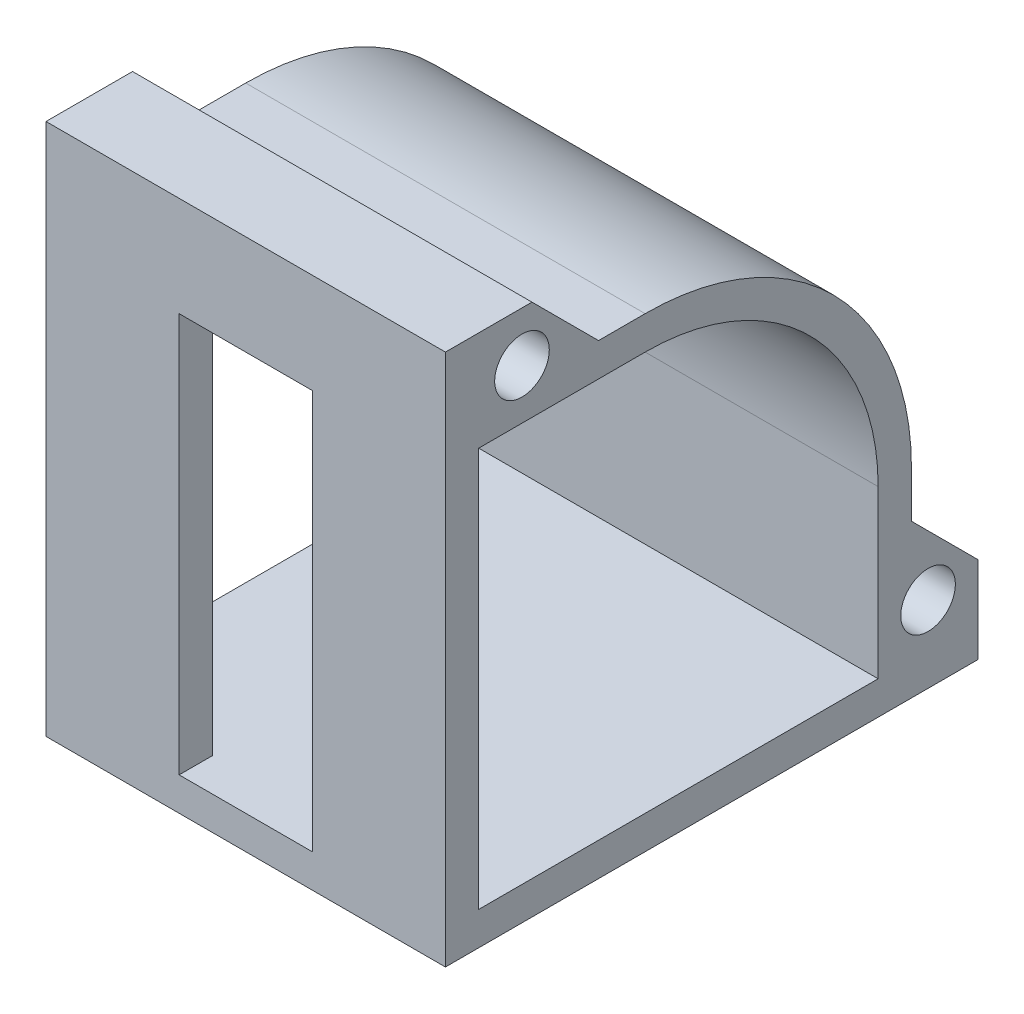
ISO-10303-21;
HEADER;
FILE_DESCRIPTION(('STEP AP214'),'2;1');
FILE_NAME('part.step','',(''),(''),'','','');
FILE_SCHEMA(('AUTOMOTIVE_DESIGN { 1 0 10303 214 1 1 1 1 }'));
ENDSEC;
DATA;
#1=APPLICATION_CONTEXT('core data for automotive mechanical design processes');
#2=APPLICATION_PROTOCOL_DEFINITION('international standard','automotive_design',2000,#1);
#3=PRODUCT_CONTEXT('',#1,'mechanical');
#4=PRODUCT('Part','Part','',(#3));
#5=PRODUCT_RELATED_PRODUCT_CATEGORY('part','',(#4));
#6=PRODUCT_DEFINITION_FORMATION('','',#4);
#7=PRODUCT_DEFINITION_CONTEXT('part definition',#1,'design');
#8=PRODUCT_DEFINITION('design','',#6,#7);
#9=PRODUCT_DEFINITION_SHAPE('','',#8);
#10=(LENGTH_UNIT() NAMED_UNIT(*) SI_UNIT(.MILLI.,.METRE.));
#11=(NAMED_UNIT(*) PLANE_ANGLE_UNIT() SI_UNIT($,.RADIAN.));
#12=(NAMED_UNIT(*) SI_UNIT($,.STERADIAN.) SOLID_ANGLE_UNIT());
#13=UNCERTAINTY_MEASURE_WITH_UNIT(LENGTH_MEASURE(1.E-05),#10,'distance_accuracy_value','');
#14=(GEOMETRIC_REPRESENTATION_CONTEXT(3) GLOBAL_UNCERTAINTY_ASSIGNED_CONTEXT((#13)) GLOBAL_UNIT_ASSIGNED_CONTEXT((#10,
#11,#12)) REPRESENTATION_CONTEXT('',''));
#15=CARTESIAN_POINT('',(0.,0.,0.));
#16=DIRECTION('',(0.,0.,1.));
#17=DIRECTION('',(1.,0.,0.));
#18=AXIS2_PLACEMENT_3D('',#15,#16,#17);
#19=CARTESIAN_POINT('',(60.,35.,25.));
#20=DIRECTION('',(0.,0.,-1.));
#21=DIRECTION('',(0.,1.,0.));
#22=AXIS2_PLACEMENT_3D('',#19,#20,#21);
#23=PLANE('',#22);
#24=DIRECTION('',(0.,-1.,0.));
#25=VECTOR('',#24,1.);
#26=CARTESIAN_POINT('',(20.,-25.,25.));
#27=LINE('',#26,#25);
#28=CARTESIAN_POINT('',(20.,35.,25.));
#29=VERTEX_POINT('',#28);
#30=CARTESIAN_POINT('',(20.,-25.,25.));
#31=VERTEX_POINT('',#30);
#32=EDGE_CURVE('E226',#29,#31,#27,.T.);
#33=ORIENTED_EDGE('',*,*,#32,.T.);
#34=DIRECTION('',(-1.,0.,0.));
#35=VECTOR('',#34,1.);
#36=CARTESIAN_POINT('',(60.,-25.,25.));
#37=LINE('',#36,#35);
#38=CARTESIAN_POINT('',(0.,-25.,25.));
#39=VERTEX_POINT('',#38);
#40=EDGE_CURVE('E283',#31,#39,#37,.T.);
#41=ORIENTED_EDGE('',*,*,#40,.T.);
#42=DIRECTION('',(0.,-1.,0.));
#43=VECTOR('',#42,1.);
#44=CARTESIAN_POINT('',(0.,35.,25.));
#45=LINE('',#44,#43);
#46=CARTESIAN_POINT('',(0.,35.,25.));
#47=VERTEX_POINT('',#46);
#48=EDGE_CURVE('E267',#47,#39,#45,.T.);
#49=ORIENTED_EDGE('',*,*,#48,.F.);
#50=DIRECTION('',(-1.,0.,0.));
#51=VECTOR('',#50,1.);
#52=CARTESIAN_POINT('',(60.,35.,25.));
#53=LINE('',#52,#51);
#54=EDGE_CURVE('E287',#29,#47,#53,.T.);
#55=ORIENTED_EDGE('',*,*,#54,.F.);
#56=EDGE_LOOP('',(#33,#41,#49,#55));
#57=FACE_BOUND('',#56,.T.);
#58=ADVANCED_FACE('F41',(#57),#23,.T.);
#59=CARTESIAN_POINT('',(60.,0.,0.));
#60=DIRECTION('',(-1.,0.,0.));
#61=DIRECTION('',(0.,0.,1.));
#62=AXIS2_PLACEMENT_3D('',#59,#60,#61);
#63=PLANE('',#62);
#64=DIRECTION('',(0.,0.707106781186547,0.707106781186548));
#65=VECTOR('',#64,1.);
#66=CARTESIAN_POINT('',(60.,-17.,-50.));
#67=LINE('',#66,#65);
#68=CARTESIAN_POINT('',(60.,-17.,-50.));
#69=VERTEX_POINT('',#68);
#70=CARTESIAN_POINT('',(60.,-7.,-40.));
#71=VERTEX_POINT('',#70);
#72=EDGE_CURVE('E311',#69,#71,#67,.T.);
#73=ORIENTED_EDGE('',*,*,#72,.T.);
#74=DIRECTION('',(0.,-1.,0.));
#75=VECTOR('',#74,1.);
#76=CARTESIAN_POINT('',(60.,-7.,-40.));
#77=LINE('',#76,#75);
#78=CARTESIAN_POINT('',(60.,0.,-40.));
#79=VERTEX_POINT('',#78);
#80=EDGE_CURVE('E185',#79,#71,#77,.T.);
#81=ORIENTED_EDGE('',*,*,#80,.F.);
#82=CARTESIAN_POINT('',(60.,0.,0.));
#83=DIRECTION('',(-1.,0.,0.));
#84=DIRECTION('',(0.,0.,1.));
#85=AXIS2_PLACEMENT_3D('',#82,#83,#84);
#86=CIRCLE('',#85,40.);
#87=CARTESIAN_POINT('',(60.,40.,0.));
#88=VERTEX_POINT('',#87);
#89=EDGE_CURVE('E169',#88,#79,#86,.T.);
#90=ORIENTED_EDGE('',*,*,#89,.F.);
#91=DIRECTION('',(0.,0.,-1.));
#92=VECTOR('',#91,1.);
#93=CARTESIAN_POINT('',(60.,40.,0.));
#94=LINE('',#93,#92);
#95=CARTESIAN_POINT('',(60.,40.,7.));
#96=VERTEX_POINT('',#95);
#97=EDGE_CURVE('E183',#96,#88,#94,.T.);
#98=ORIENTED_EDGE('',*,*,#97,.F.);
#99=DIRECTION('',(0.,0.707106781186547,0.707106781186549));
#100=VECTOR('',#99,1.);
#101=CARTESIAN_POINT('',(60.,40.,7.));
#102=LINE('',#101,#100);
#103=CARTESIAN_POINT('',(60.,50.,17.));
#104=VERTEX_POINT('',#103);
#105=EDGE_CURVE('E62',#96,#104,#102,.T.);
#106=ORIENTED_EDGE('',*,*,#105,.T.);
#107=DIRECTION('',(0.,0.,1.));
#108=VECTOR('',#107,1.);
#109=CARTESIAN_POINT('',(60.,50.,30.));
#110=LINE('',#109,#108);
#111=CARTESIAN_POINT('',(60.,50.,30.));
#112=VERTEX_POINT('',#111);
#113=EDGE_CURVE('E215',#104,#112,#110,.T.);
#114=ORIENTED_EDGE('',*,*,#113,.T.);
#115=DIRECTION('',(0.,-1.,0.));
#116=VECTOR('',#115,1.);
#117=CARTESIAN_POINT('',(60.,-30.,30.));
#118=LINE('',#117,#116);
#119=CARTESIAN_POINT('',(60.,-30.,30.));
#120=VERTEX_POINT('',#119);
#121=EDGE_CURVE('E291',#112,#120,#118,.T.);
#122=ORIENTED_EDGE('',*,*,#121,.T.);
#123=DIRECTION('',(0.,0.,-1.));
#124=VECTOR('',#123,1.);
#125=CARTESIAN_POINT('',(60.,-30.,-40.));
#126=LINE('',#125,#124);
#127=CARTESIAN_POINT('',(60.,-30.,-50.));
#128=VERTEX_POINT('',#127);
#129=EDGE_CURVE('E293',#120,#128,#126,.T.);
#130=ORIENTED_EDGE('',*,*,#129,.T.);
#131=DIRECTION('',(0.,1.,0.));
#132=VECTOR('',#131,1.);
#133=CARTESIAN_POINT('',(60.,-7.,-50.));
#134=LINE('',#133,#132);
#135=EDGE_CURVE('E206',#128,#69,#134,.T.);
#136=ORIENTED_EDGE('',*,*,#135,.T.);
#137=EDGE_LOOP('',(#73,#81,#90,#98,#106,#114,#122,#130,#136));
#138=FACE_BOUND('',#137,.T.);
#139=CARTESIAN_POINT('',(60.,-18.5,-42.5));
#140=DIRECTION('',(1.,0.,0.));
#141=DIRECTION('',(0.,0.,-1.));
#142=AXIS2_PLACEMENT_3D('',#139,#140,#141);
#143=CIRCLE('',#142,4.1);
#144=CARTESIAN_POINT('',(60.,-18.5,-46.6));
#145=VERTEX_POINT('',#144);
#146=EDGE_CURVE('E186',#145,#145,#143,.T.);
#147=ORIENTED_EDGE('',*,*,#146,.F.);
#148=EDGE_LOOP('',(#147));
#149=FACE_BOUND('',#148,.T.);
#150=CARTESIAN_POINT('',(60.,42.5,18.5));
#151=DIRECTION('',(1.,0.,0.));
#152=DIRECTION('',(0.,0.,-1.));
#153=AXIS2_PLACEMENT_3D('',#150,#151,#152);
#154=CIRCLE('',#153,4.1);
#155=CARTESIAN_POINT('',(60.,42.5,14.4));
#156=VERTEX_POINT('',#155);
#157=EDGE_CURVE('E200',#156,#156,#154,.T.);
#158=ORIENTED_EDGE('',*,*,#157,.F.);
#159=EDGE_LOOP('',(#158));
#160=FACE_BOUND('',#159,.T.);
#161=CARTESIAN_POINT('',(60.,0.,0.));
#162=DIRECTION('',(-1.,0.,0.));
#163=DIRECTION('',(0.,0.,1.));
#164=AXIS2_PLACEMENT_3D('',#161,#162,#163);
#165=CIRCLE('',#164,35.);
#166=CARTESIAN_POINT('',(60.,0.,-35.));
#167=VERTEX_POINT('',#166);
#168=CARTESIAN_POINT('',(60.,35.,0.));
#169=VERTEX_POINT('',#168);
#170=EDGE_CURVE('E191',#167,#169,#165,.F.);
#171=ORIENTED_EDGE('',*,*,#170,.F.);
#172=DIRECTION('',(0.,1.,0.));
#173=VECTOR('',#172,1.);
#174=CARTESIAN_POINT('',(60.,-25.,-35.));
#175=LINE('',#174,#173);
#176=CARTESIAN_POINT('',(60.,-25.,-35.));
#177=VERTEX_POINT('',#176);
#178=EDGE_CURVE('E262',#177,#167,#175,.T.);
#179=ORIENTED_EDGE('',*,*,#178,.F.);
#180=DIRECTION('',(0.,0.,-1.));
#181=VECTOR('',#180,1.);
#182=CARTESIAN_POINT('',(60.,-25.,25.));
#183=LINE('',#182,#181);
#184=CARTESIAN_POINT('',(60.,-25.,25.));
#185=VERTEX_POINT('',#184);
#186=EDGE_CURVE('E260',#185,#177,#183,.T.);
#187=ORIENTED_EDGE('',*,*,#186,.F.);
#188=DIRECTION('',(0.,-1.,0.));
#189=VECTOR('',#188,1.);
#190=CARTESIAN_POINT('',(60.,35.,25.));
#191=LINE('',#190,#189);
#192=CARTESIAN_POINT('',(60.,35.,25.));
#193=VERTEX_POINT('',#192);
#194=EDGE_CURVE('E257',#193,#185,#191,.T.);
#195=ORIENTED_EDGE('',*,*,#194,.F.);
#196=DIRECTION('',(0.,0.,1.));
#197=VECTOR('',#196,1.);
#198=CARTESIAN_POINT('',(60.,35.,25.));
#199=LINE('',#198,#197);
#200=EDGE_CURVE('E255',#169,#193,#199,.T.);
#201=ORIENTED_EDGE('',*,*,#200,.F.);
#202=EDGE_LOOP('',(#171,#179,#187,#195,#201));
#203=FACE_BOUND('',#202,.T.);
#204=ADVANCED_FACE('F181',(#138,#149,#160,#203),#63,.F.);
#205=CARTESIAN_POINT('',(0.,0.,0.));
#206=DIRECTION('',(-1.,0.,0.));
#207=DIRECTION('',(0.,0.,1.));
#208=AXIS2_PLACEMENT_3D('',#205,#206,#207);
#209=PLANE('',#208);
#210=CARTESIAN_POINT('',(0.,-18.5,-42.5));
#211=DIRECTION('',(1.,0.,0.));
#212=DIRECTION('',(0.,0.,-1.));
#213=AXIS2_PLACEMENT_3D('',#210,#211,#212);
#214=CIRCLE('',#213,4.1);
#215=CARTESIAN_POINT('',(0.,-18.5,-46.6));
#216=VERTEX_POINT('',#215);
#217=EDGE_CURVE('E197',#216,#216,#214,.T.);
#218=ORIENTED_EDGE('',*,*,#217,.T.);
#219=EDGE_LOOP('',(#218));
#220=FACE_BOUND('',#219,.T.);
#221=CARTESIAN_POINT('',(0.,42.5,18.5));
#222=DIRECTION('',(1.,0.,0.));
#223=DIRECTION('',(0.,0.,-1.));
#224=AXIS2_PLACEMENT_3D('',#221,#222,#223);
#225=CIRCLE('',#224,4.1);
#226=CARTESIAN_POINT('',(0.,42.5,14.4));
#227=VERTEX_POINT('',#226);
#228=EDGE_CURVE('E203',#227,#227,#225,.T.);
#229=ORIENTED_EDGE('',*,*,#228,.T.);
#230=EDGE_LOOP('',(#229));
#231=FACE_BOUND('',#230,.T.);
#232=DIRECTION('',(0.,1.,0.));
#233=VECTOR('',#232,1.);
#234=CARTESIAN_POINT('',(0.,-30.,-40.));
#235=LINE('',#234,#233);
#236=CARTESIAN_POINT('',(0.,-7.00000000000001,-40.));
#237=VERTEX_POINT('',#236);
#238=CARTESIAN_POINT('',(0.,0.,-40.));
#239=VERTEX_POINT('',#238);
#240=EDGE_CURVE('E294',#237,#239,#235,.T.);
#241=ORIENTED_EDGE('',*,*,#240,.F.);
#242=DIRECTION('',(0.,-0.707106781186547,-0.707106781186548));
#243=VECTOR('',#242,1.);
#244=CARTESIAN_POINT('',(0.,16.5,-16.4999999999999));
#245=LINE('',#244,#243);
#246=CARTESIAN_POINT('',(0.,-17.,-50.));
#247=VERTEX_POINT('',#246);
#248=EDGE_CURVE('E49',#237,#247,#245,.T.);
#249=ORIENTED_EDGE('',*,*,#248,.T.);
#250=DIRECTION('',(0.,1.,0.));
#251=VECTOR('',#250,1.);
#252=CARTESIAN_POINT('',(0.,-7.,-50.));
#253=LINE('',#252,#251);
#254=CARTESIAN_POINT('',(0.,-30.,-50.));
#255=VERTEX_POINT('',#254);
#256=EDGE_CURVE('E212',#255,#247,#253,.T.);
#257=ORIENTED_EDGE('',*,*,#256,.F.);
#258=DIRECTION('',(0.,0.,-1.));
#259=VECTOR('',#258,1.);
#260=CARTESIAN_POINT('',(0.,-30.,-40.));
#261=LINE('',#260,#259);
#262=CARTESIAN_POINT('',(0.,-30.,30.));
#263=VERTEX_POINT('',#262);
#264=EDGE_CURVE('E302',#263,#255,#261,.T.);
#265=ORIENTED_EDGE('',*,*,#264,.F.);
#266=DIRECTION('',(0.,-1.,0.));
#267=VECTOR('',#266,1.);
#268=CARTESIAN_POINT('',(0.,-30.,30.));
#269=LINE('',#268,#267);
#270=CARTESIAN_POINT('',(0.,50.,30.));
#271=VERTEX_POINT('',#270);
#272=EDGE_CURVE('E300',#271,#263,#269,.T.);
#273=ORIENTED_EDGE('',*,*,#272,.F.);
#274=DIRECTION('',(0.,0.,1.));
#275=VECTOR('',#274,1.);
#276=CARTESIAN_POINT('',(0.,50.,30.));
#277=LINE('',#276,#275);
#278=CARTESIAN_POINT('',(0.,50.,17.));
#279=VERTEX_POINT('',#278);
#280=EDGE_CURVE('E221',#279,#271,#277,.T.);
#281=ORIENTED_EDGE('',*,*,#280,.F.);
#282=DIRECTION('',(0.,-0.707106781186547,-0.707106781186549));
#283=VECTOR('',#282,1.);
#284=CARTESIAN_POINT('',(0.,16.5000000000001,-16.5));
#285=LINE('',#284,#283);
#286=CARTESIAN_POINT('',(0.,40.,7.));
#287=VERTEX_POINT('',#286);
#288=EDGE_CURVE('E313',#279,#287,#285,.T.);
#289=ORIENTED_EDGE('',*,*,#288,.T.);
#290=DIRECTION('',(0.,0.,1.));
#291=VECTOR('',#290,1.);
#292=CARTESIAN_POINT('',(0.,40.,0.));
#293=LINE('',#292,#291);
#294=CARTESIAN_POINT('',(0.,40.,0.));
#295=VERTEX_POINT('',#294);
#296=EDGE_CURVE('E298',#295,#287,#293,.T.);
#297=ORIENTED_EDGE('',*,*,#296,.F.);
#298=CARTESIAN_POINT('',(0.,0.,0.));
#299=DIRECTION('',(1.,0.,0.));
#300=DIRECTION('',(0.,0.,1.));
#301=AXIS2_PLACEMENT_3D('',#298,#299,#300);
#302=CIRCLE('',#301,40.);
#303=EDGE_CURVE('E171',#239,#295,#302,.T.);
#304=ORIENTED_EDGE('',*,*,#303,.F.);
#305=EDGE_LOOP('',(#241,#249,#257,#265,#273,#281,#289,#297,#304));
#306=FACE_BOUND('',#305,.T.);
#307=CARTESIAN_POINT('',(0.,0.,0.));
#308=DIRECTION('',(1.,0.,0.));
#309=DIRECTION('',(0.,0.,1.));
#310=AXIS2_PLACEMENT_3D('',#307,#308,#309);
#311=CIRCLE('',#310,35.);
#312=CARTESIAN_POINT('',(0.,0.,-35.));
#313=VERTEX_POINT('',#312);
#314=CARTESIAN_POINT('',(0.,35.,0.));
#315=VERTEX_POINT('',#314);
#316=EDGE_CURVE('E258',#313,#315,#311,.T.);
#317=ORIENTED_EDGE('',*,*,#316,.T.);
#318=DIRECTION('',(0.,0.,1.));
#319=VECTOR('',#318,1.);
#320=CARTESIAN_POINT('',(0.,35.,25.));
#321=LINE('',#320,#319);
#322=EDGE_CURVE('E231',#315,#47,#321,.T.);
#323=ORIENTED_EDGE('',*,*,#322,.T.);
#324=ORIENTED_EDGE('',*,*,#48,.T.);
#325=DIRECTION('',(0.,0.,-1.));
#326=VECTOR('',#325,1.);
#327=CARTESIAN_POINT('',(0.,-25.,25.));
#328=LINE('',#327,#326);
#329=CARTESIAN_POINT('',(0.,-25.,-35.));
#330=VERTEX_POINT('',#329);
#331=EDGE_CURVE('E270',#39,#330,#328,.T.);
#332=ORIENTED_EDGE('',*,*,#331,.T.);
#333=DIRECTION('',(0.,1.,0.));
#334=VECTOR('',#333,1.);
#335=CARTESIAN_POINT('',(0.,-25.,-35.));
#336=LINE('',#335,#334);
#337=EDGE_CURVE('E273',#330,#313,#336,.T.);
#338=ORIENTED_EDGE('',*,*,#337,.T.);
#339=EDGE_LOOP('',(#317,#323,#324,#332,#338));
#340=FACE_BOUND('',#339,.T.);
#341=ADVANCED_FACE('F318',(#220,#231,#306,#340),#209,.T.);
#342=CARTESIAN_POINT('',(60.,0.,0.));
#343=DIRECTION('',(-1.,0.,0.));
#344=DIRECTION('',(0.,0.,1.));
#345=AXIS2_PLACEMENT_3D('',#342,#343,#344);
#346=CYLINDRICAL_SURFACE('',#345,40.);
#347=DIRECTION('',(-1.,0.,0.));
#348=VECTOR('',#347,1.);
#349=CARTESIAN_POINT('',(60.,40.,0.));
#350=LINE('',#349,#348);
#351=EDGE_CURVE('E165',#88,#295,#350,.T.);
#352=ORIENTED_EDGE('',*,*,#351,.F.);
#353=ORIENTED_EDGE('',*,*,#89,.T.);
#354=DIRECTION('',(-1.,0.,0.));
#355=VECTOR('',#354,1.);
#356=CARTESIAN_POINT('',(60.,0.,-40.));
#357=LINE('',#356,#355);
#358=EDGE_CURVE('E296',#79,#239,#357,.T.);
#359=ORIENTED_EDGE('',*,*,#358,.T.);
#360=ORIENTED_EDGE('',*,*,#303,.T.);
#361=EDGE_LOOP('',(#352,#353,#359,#360));
#362=FACE_BOUND('',#361,.T.);
#363=ADVANCED_FACE('F167',(#362),#346,.T.);
#364=CARTESIAN_POINT('',(60.,40.,0.));
#365=DIRECTION('',(0.,-1.,0.));
#366=DIRECTION('',(0.,0.,-1.));
#367=AXIS2_PLACEMENT_3D('',#364,#365,#366);
#368=PLANE('',#367);
#369=ORIENTED_EDGE('',*,*,#296,.T.);
#370=DIRECTION('',(1.,0.,0.));
#371=VECTOR('',#370,1.);
#372=CARTESIAN_POINT('',(-25.0798724079689,40.,7.));
#373=LINE('',#372,#371);
#374=EDGE_CURVE('E190',#287,#96,#373,.T.);
#375=ORIENTED_EDGE('',*,*,#374,.T.);
#376=ORIENTED_EDGE('',*,*,#97,.T.);
#377=ORIENTED_EDGE('',*,*,#351,.T.);
#378=EDGE_LOOP('',(#369,#375,#376,#377));
#379=FACE_BOUND('',#378,.T.);
#380=ADVANCED_FACE('F188',(#379),#368,.F.);
#381=CARTESIAN_POINT('',(60.,-30.,30.));
#382=DIRECTION('',(0.,0.,-1.));
#383=DIRECTION('',(-1.,0.,0.));
#384=AXIS2_PLACEMENT_3D('',#381,#382,#383);
#385=PLANE('',#384);
#386=DIRECTION('',(1.,0.,0.));
#387=VECTOR('',#386,1.);
#388=CARTESIAN_POINT('',(40.,-25.,30.));
#389=LINE('',#388,#387);
#390=CARTESIAN_POINT('',(20.,-25.,30.));
#391=VERTEX_POINT('',#390);
#392=CARTESIAN_POINT('',(40.,-25.,30.));
#393=VERTEX_POINT('',#392);
#394=EDGE_CURVE('E235',#391,#393,#389,.T.);
#395=ORIENTED_EDGE('',*,*,#394,.F.);
#396=DIRECTION('',(0.,-1.,0.));
#397=VECTOR('',#396,1.);
#398=CARTESIAN_POINT('',(20.,-25.,30.));
#399=LINE('',#398,#397);
#400=CARTESIAN_POINT('',(20.,35.,30.));
#401=VERTEX_POINT('',#400);
#402=EDGE_CURVE('E238',#401,#391,#399,.T.);
#403=ORIENTED_EDGE('',*,*,#402,.F.);
#404=DIRECTION('',(-1.,0.,0.));
#405=VECTOR('',#404,1.);
#406=CARTESIAN_POINT('',(40.,35.,30.));
#407=LINE('',#406,#405);
#408=CARTESIAN_POINT('',(40.,35.,30.));
#409=VERTEX_POINT('',#408);
#410=EDGE_CURVE('E228',#409,#401,#407,.T.);
#411=ORIENTED_EDGE('',*,*,#410,.F.);
#412=DIRECTION('',(0.,1.,0.));
#413=VECTOR('',#412,1.);
#414=CARTESIAN_POINT('',(40.,-25.,30.));
#415=LINE('',#414,#413);
#416=EDGE_CURVE('E232',#393,#409,#415,.T.);
#417=ORIENTED_EDGE('',*,*,#416,.F.);
#418=EDGE_LOOP('',(#395,#403,#411,#417));
#419=FACE_BOUND('',#418,.T.);
#420=ORIENTED_EDGE('',*,*,#272,.T.);
#421=DIRECTION('',(-1.,0.,0.));
#422=VECTOR('',#421,1.);
#423=CARTESIAN_POINT('',(60.,-30.,30.));
#424=LINE('',#423,#422);
#425=EDGE_CURVE('E177',#120,#263,#424,.T.);
#426=ORIENTED_EDGE('',*,*,#425,.F.);
#427=ORIENTED_EDGE('',*,*,#121,.F.);
#428=DIRECTION('',(1.,0.,0.));
#429=VECTOR('',#428,1.);
#430=CARTESIAN_POINT('',(-25.0798724079689,50.,30.));
#431=LINE('',#430,#429);
#432=EDGE_CURVE('E223',#271,#112,#431,.T.);
#433=ORIENTED_EDGE('',*,*,#432,.F.);
#434=EDGE_LOOP('',(#420,#426,#427,#433));
#435=FACE_BOUND('',#434,.T.);
#436=ADVANCED_FACE('F377',(#419,#435),#385,.F.);
#437=CARTESIAN_POINT('',(60.,-30.,-40.));
#438=DIRECTION('',(0.,1.,0.));
#439=DIRECTION('',(0.,0.,1.));
#440=AXIS2_PLACEMENT_3D('',#437,#438,#439);
#441=PLANE('',#440);
#442=ORIENTED_EDGE('',*,*,#264,.T.);
#443=DIRECTION('',(1.,0.,0.));
#444=VECTOR('',#443,1.);
#445=CARTESIAN_POINT('',(-25.0798724079689,-30.,-50.));
#446=LINE('',#445,#444);
#447=EDGE_CURVE('E216',#255,#128,#446,.T.);
#448=ORIENTED_EDGE('',*,*,#447,.T.);
#449=ORIENTED_EDGE('',*,*,#129,.F.);
#450=ORIENTED_EDGE('',*,*,#425,.T.);
#451=EDGE_LOOP('',(#442,#448,#449,#450));
#452=FACE_BOUND('',#451,.T.);
#453=ADVANCED_FACE('F469',(#452),#441,.F.);
#454=CARTESIAN_POINT('',(60.,-30.,-40.));
#455=DIRECTION('',(0.,0.,1.));
#456=DIRECTION('',(0.,-1.,0.));
#457=AXIS2_PLACEMENT_3D('',#454,#455,#456);
#458=PLANE('',#457);
#459=ORIENTED_EDGE('',*,*,#358,.F.);
#460=ORIENTED_EDGE('',*,*,#80,.T.);
#461=DIRECTION('',(1.,0.,0.));
#462=VECTOR('',#461,1.);
#463=CARTESIAN_POINT('',(-25.0798724079689,-7.,-40.));
#464=LINE('',#463,#462);
#465=EDGE_CURVE('E211',#237,#71,#464,.T.);
#466=ORIENTED_EDGE('',*,*,#465,.F.);
#467=ORIENTED_EDGE('',*,*,#240,.T.);
#468=EDGE_LOOP('',(#459,#460,#466,#467));
#469=FACE_BOUND('',#468,.T.);
#470=ADVANCED_FACE('F329',(#469),#458,.F.);
#471=CARTESIAN_POINT('',(60.,35.,25.));
#472=DIRECTION('',(0.,-1.,0.));
#473=DIRECTION('',(0.,0.,-1.));
#474=AXIS2_PLACEMENT_3D('',#471,#472,#473);
#475=PLANE('',#474);
#476=DIRECTION('',(-1.,0.,0.));
#477=VECTOR('',#476,1.);
#478=CARTESIAN_POINT('',(60.,35.,0.));
#479=LINE('',#478,#477);
#480=EDGE_CURVE('E264',#169,#315,#479,.T.);
#481=ORIENTED_EDGE('',*,*,#480,.F.);
#482=ORIENTED_EDGE('',*,*,#200,.T.);
#483=CARTESIAN_POINT('',(40.,35.,25.));
#484=VERTEX_POINT('',#483);
#485=EDGE_CURVE('E288',#193,#484,#53,.T.);
#486=ORIENTED_EDGE('',*,*,#485,.T.);
#487=DIRECTION('',(0.,0.,1.));
#488=VECTOR('',#487,1.);
#489=CARTESIAN_POINT('',(40.,35.,-40.001));
#490=LINE('',#489,#488);
#491=EDGE_CURVE('E248',#484,#409,#490,.T.);
#492=ORIENTED_EDGE('',*,*,#491,.T.);
#493=ORIENTED_EDGE('',*,*,#410,.T.);
#494=DIRECTION('',(0.,0.,1.));
#495=VECTOR('',#494,1.);
#496=CARTESIAN_POINT('',(20.,35.,-40.001));
#497=LINE('',#496,#495);
#498=EDGE_CURVE('E249',#29,#401,#497,.T.);
#499=ORIENTED_EDGE('',*,*,#498,.F.);
#500=ORIENTED_EDGE('',*,*,#54,.T.);
#501=ORIENTED_EDGE('',*,*,#322,.F.);
#502=EDGE_LOOP('',(#481,#482,#486,#492,#493,#499,#500,#501));
#503=FACE_BOUND('',#502,.T.);
#504=ADVANCED_FACE('F349',(#503),#475,.T.);
#505=DIRECTION('',(0.,1.,0.));
#506=VECTOR('',#505,1.);
#507=CARTESIAN_POINT('',(40.,-25.,25.));
#508=LINE('',#507,#506);
#509=CARTESIAN_POINT('',(40.,-25.,25.));
#510=VERTEX_POINT('',#509);
#511=EDGE_CURVE('E245',#510,#484,#508,.T.);
#512=ORIENTED_EDGE('',*,*,#511,.T.);
#513=ORIENTED_EDGE('',*,*,#485,.F.);
#514=ORIENTED_EDGE('',*,*,#194,.T.);
#515=EDGE_CURVE('E284',#185,#510,#37,.T.);
#516=ORIENTED_EDGE('',*,*,#515,.T.);
#517=EDGE_LOOP('',(#512,#513,#514,#516));
#518=FACE_BOUND('',#517,.T.);
#519=ADVANCED_FACE('F340',(#518),#23,.T.);
#520=CARTESIAN_POINT('',(60.,-25.,25.));
#521=DIRECTION('',(0.,1.,0.));
#522=DIRECTION('',(0.,0.,1.));
#523=AXIS2_PLACEMENT_3D('',#520,#521,#522);
#524=PLANE('',#523);
#525=ORIENTED_EDGE('',*,*,#331,.F.);
#526=ORIENTED_EDGE('',*,*,#40,.F.);
#527=DIRECTION('',(0.,0.,1.));
#528=VECTOR('',#527,1.);
#529=CARTESIAN_POINT('',(20.,-25.,-40.001));
#530=LINE('',#529,#528);
#531=EDGE_CURVE('E244',#31,#391,#530,.T.);
#532=ORIENTED_EDGE('',*,*,#531,.T.);
#533=ORIENTED_EDGE('',*,*,#394,.T.);
#534=DIRECTION('',(0.,0.,1.));
#535=VECTOR('',#534,1.);
#536=CARTESIAN_POINT('',(40.,-25.,-40.001));
#537=LINE('',#536,#535);
#538=EDGE_CURVE('E240',#510,#393,#537,.T.);
#539=ORIENTED_EDGE('',*,*,#538,.F.);
#540=ORIENTED_EDGE('',*,*,#515,.F.);
#541=ORIENTED_EDGE('',*,*,#186,.T.);
#542=DIRECTION('',(-1.,0.,0.));
#543=VECTOR('',#542,1.);
#544=CARTESIAN_POINT('',(60.,-25.,-35.));
#545=LINE('',#544,#543);
#546=EDGE_CURVE('E281',#177,#330,#545,.T.);
#547=ORIENTED_EDGE('',*,*,#546,.T.);
#548=EDGE_LOOP('',(#525,#526,#532,#533,#539,#540,#541,#547));
#549=FACE_BOUND('',#548,.T.);
#550=ADVANCED_FACE('F348',(#549),#524,.T.);
#551=CARTESIAN_POINT('',(60.,-25.,-35.));
#552=DIRECTION('',(0.,0.,1.));
#553=DIRECTION('',(0.,-1.,0.));
#554=AXIS2_PLACEMENT_3D('',#551,#552,#553);
#555=PLANE('',#554);
#556=ORIENTED_EDGE('',*,*,#178,.T.);
#557=DIRECTION('',(-1.,0.,0.));
#558=VECTOR('',#557,1.);
#559=CARTESIAN_POINT('',(60.,0.,-35.));
#560=LINE('',#559,#558);
#561=EDGE_CURVE('E279',#167,#313,#560,.T.);
#562=ORIENTED_EDGE('',*,*,#561,.T.);
#563=ORIENTED_EDGE('',*,*,#337,.F.);
#564=ORIENTED_EDGE('',*,*,#546,.F.);
#565=EDGE_LOOP('',(#556,#562,#563,#564));
#566=FACE_BOUND('',#565,.T.);
#567=ADVANCED_FACE('F355',(#566),#555,.T.);
#568=CARTESIAN_POINT('',(60.,0.,0.));
#569=DIRECTION('',(-1.,0.,0.));
#570=DIRECTION('',(0.,0.,1.));
#571=AXIS2_PLACEMENT_3D('',#568,#569,#570);
#572=CYLINDRICAL_SURFACE('',#571,35.);
#573=ORIENTED_EDGE('',*,*,#561,.F.);
#574=ORIENTED_EDGE('',*,*,#170,.T.);
#575=ORIENTED_EDGE('',*,*,#480,.T.);
#576=ORIENTED_EDGE('',*,*,#316,.F.);
#577=EDGE_LOOP('',(#573,#574,#575,#576));
#578=FACE_BOUND('',#577,.T.);
#579=ADVANCED_FACE('F388',(#578),#572,.F.);
#580=CARTESIAN_POINT('',(20.,-25.,-40.001));
#581=DIRECTION('',(-1.,0.,0.));
#582=DIRECTION('',(0.,0.,1.));
#583=AXIS2_PLACEMENT_3D('',#580,#581,#582);
#584=PLANE('',#583);
#585=ORIENTED_EDGE('',*,*,#498,.T.);
#586=ORIENTED_EDGE('',*,*,#402,.T.);
#587=ORIENTED_EDGE('',*,*,#531,.F.);
#588=ORIENTED_EDGE('',*,*,#32,.F.);
#589=EDGE_LOOP('',(#585,#586,#587,#588));
#590=FACE_BOUND('',#589,.T.);
#591=ADVANCED_FACE('F390',(#590),#584,.F.);
#592=CARTESIAN_POINT('',(40.,-25.,-40.001));
#593=DIRECTION('',(1.,0.,0.));
#594=DIRECTION('',(0.,0.,-1.));
#595=AXIS2_PLACEMENT_3D('',#592,#593,#594);
#596=PLANE('',#595);
#597=ORIENTED_EDGE('',*,*,#538,.T.);
#598=ORIENTED_EDGE('',*,*,#416,.T.);
#599=ORIENTED_EDGE('',*,*,#491,.F.);
#600=ORIENTED_EDGE('',*,*,#511,.F.);
#601=EDGE_LOOP('',(#597,#598,#599,#600));
#602=FACE_BOUND('',#601,.T.);
#603=ADVANCED_FACE('F373',(#602),#596,.F.);
#604=CARTESIAN_POINT('',(-25.0798724079689,50.,30.));
#605=DIRECTION('',(0.,1.,0.));
#606=DIRECTION('',(0.,0.,1.));
#607=AXIS2_PLACEMENT_3D('',#604,#605,#606);
#608=PLANE('',#607);
#609=ORIENTED_EDGE('',*,*,#113,.F.);
#610=DIRECTION('',(-1.,0.,0.));
#611=VECTOR('',#610,1.);
#612=CARTESIAN_POINT('',(0.,50.,17.));
#613=LINE('',#612,#611);
#614=EDGE_CURVE('E11',#104,#279,#613,.T.);
#615=ORIENTED_EDGE('',*,*,#614,.T.);
#616=ORIENTED_EDGE('',*,*,#280,.T.);
#617=ORIENTED_EDGE('',*,*,#432,.T.);
#618=EDGE_LOOP('',(#609,#615,#616,#617));
#619=FACE_BOUND('',#618,.T.);
#620=ADVANCED_FACE('F397',(#619),#608,.T.);
#621=CARTESIAN_POINT('',(-25.0798724079689,-7.,-50.));
#622=DIRECTION('',(0.,0.,-1.));
#623=DIRECTION('',(0.,1.,0.));
#624=AXIS2_PLACEMENT_3D('',#621,#622,#623);
#625=PLANE('',#624);
#626=ORIENTED_EDGE('',*,*,#256,.T.);
#627=DIRECTION('',(1.,0.,0.));
#628=VECTOR('',#627,1.);
#629=CARTESIAN_POINT('',(60.,-17.,-50.));
#630=LINE('',#629,#628);
#631=EDGE_CURVE('E176',#247,#69,#630,.T.);
#632=ORIENTED_EDGE('',*,*,#631,.T.);
#633=ORIENTED_EDGE('',*,*,#135,.F.);
#634=ORIENTED_EDGE('',*,*,#447,.F.);
#635=EDGE_LOOP('',(#626,#632,#633,#634));
#636=FACE_BOUND('',#635,.T.);
#637=ADVANCED_FACE('F325',(#636),#625,.T.);
#638=CARTESIAN_POINT('',(0.,42.5,18.5));
#639=DIRECTION('',(1.,0.,0.));
#640=DIRECTION('',(0.,0.,-1.));
#641=AXIS2_PLACEMENT_3D('',#638,#639,#640);
#642=CYLINDRICAL_SURFACE('',#641,4.1);
#643=ORIENTED_EDGE('',*,*,#228,.F.);
#644=EDGE_LOOP('',(#643));
#645=FACE_BOUND('',#644,.T.);
#646=ORIENTED_EDGE('',*,*,#157,.T.);
#647=EDGE_LOOP('',(#646));
#648=FACE_BOUND('',#647,.T.);
#649=ADVANCED_FACE('F536',(#645,#648),#642,.F.);
#650=CARTESIAN_POINT('',(0.,-18.5,-42.5));
#651=DIRECTION('',(1.,0.,0.));
#652=DIRECTION('',(0.,0.,-1.));
#653=AXIS2_PLACEMENT_3D('',#650,#651,#652);
#654=CYLINDRICAL_SURFACE('',#653,4.1);
#655=ORIENTED_EDGE('',*,*,#217,.F.);
#656=EDGE_LOOP('',(#655));
#657=FACE_BOUND('',#656,.T.);
#658=ORIENTED_EDGE('',*,*,#146,.T.);
#659=EDGE_LOOP('',(#658));
#660=FACE_BOUND('',#659,.T.);
#661=ADVANCED_FACE('F336',(#657,#660),#654,.F.);
#662=CARTESIAN_POINT('',(-25.0798724079689,-17.,-50.));
#663=DIRECTION('',(0.,0.707106781186548,-0.707106781186547));
#664=DIRECTION('',(-1.,0.,0.));
#665=AXIS2_PLACEMENT_3D('',#662,#663,#664);
#666=PLANE('',#665);
#667=ORIENTED_EDGE('',*,*,#465,.T.);
#668=ORIENTED_EDGE('',*,*,#72,.F.);
#669=ORIENTED_EDGE('',*,*,#631,.F.);
#670=ORIENTED_EDGE('',*,*,#248,.F.);
#671=EDGE_LOOP('',(#667,#668,#669,#670));
#672=FACE_BOUND('',#671,.T.);
#673=ADVANCED_FACE('F327',(#672),#666,.T.);
#674=CARTESIAN_POINT('',(53.,40.,7.));
#675=DIRECTION('',(0.,0.707106781186548,-0.707106781186546));
#676=DIRECTION('',(-1.,0.,0.));
#677=AXIS2_PLACEMENT_3D('',#674,#675,#676);
#678=PLANE('',#677);
#679=ORIENTED_EDGE('',*,*,#288,.F.);
#680=ORIENTED_EDGE('',*,*,#614,.F.);
#681=ORIENTED_EDGE('',*,*,#105,.F.);
#682=ORIENTED_EDGE('',*,*,#374,.F.);
#683=EDGE_LOOP('',(#679,#680,#681,#682));
#684=FACE_BOUND('',#683,.T.);
#685=ADVANCED_FACE('F43',(#684),#678,.T.);
#686=CLOSED_SHELL('',(#58,#204,#341,#363,#380,#436,#453,#470,#504,#519,#550,#567,#579,#591,#603,
#620,#637,#649,#661,#673,#685));
#687=MANIFOLD_SOLID_BREP('B2',#686);
#688=ADVANCED_BREP_SHAPE_REPRESENTATION('',(#18,#687),#14);
#689=SHAPE_DEFINITION_REPRESENTATION(#9,#688);
ENDSEC;
END-ISO-10303-21;
